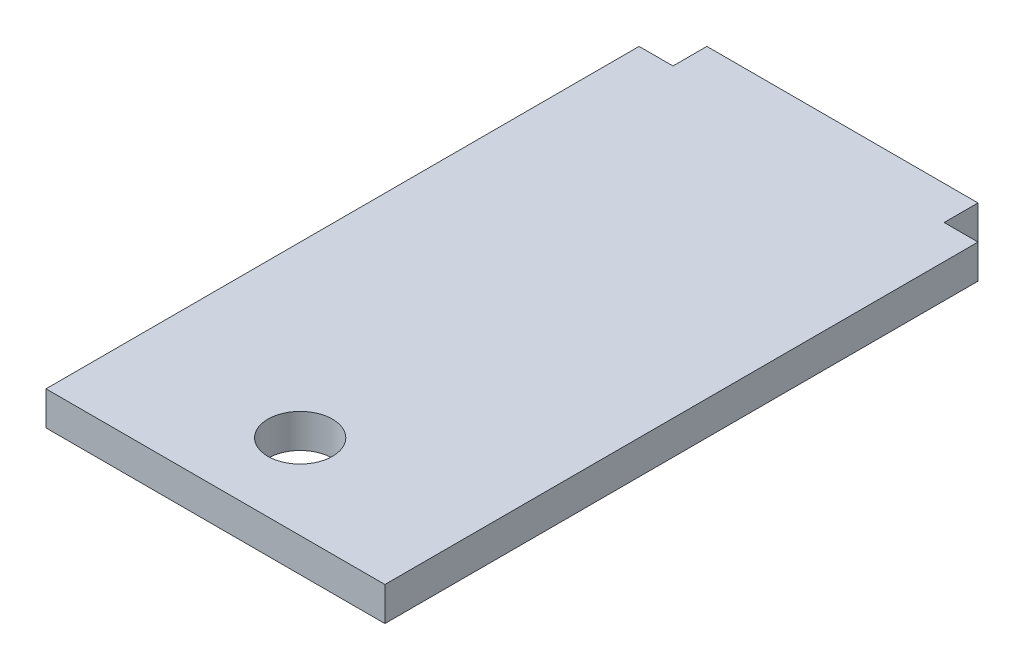
ISO-10303-21;
HEADER;
FILE_DESCRIPTION(('STEP AP214'),'2;1');
FILE_NAME('part.step','',(''),(''),'','','');
FILE_SCHEMA(('AUTOMOTIVE_DESIGN { 1 0 10303 214 1 1 1 1 }'));
ENDSEC;
DATA;
#1=APPLICATION_CONTEXT('core data for automotive mechanical design processes');
#2=APPLICATION_PROTOCOL_DEFINITION('international standard','automotive_design',2000,#1);
#3=PRODUCT_CONTEXT('',#1,'mechanical');
#4=PRODUCT('Part','Part','',(#3));
#5=PRODUCT_RELATED_PRODUCT_CATEGORY('part','',(#4));
#6=PRODUCT_DEFINITION_FORMATION('','',#4);
#7=PRODUCT_DEFINITION_CONTEXT('part definition',#1,'design');
#8=PRODUCT_DEFINITION('design','',#6,#7);
#9=PRODUCT_DEFINITION_SHAPE('','',#8);
#10=(LENGTH_UNIT() NAMED_UNIT(*) SI_UNIT(.MILLI.,.METRE.));
#11=(NAMED_UNIT(*) PLANE_ANGLE_UNIT() SI_UNIT($,.RADIAN.));
#12=(NAMED_UNIT(*) SI_UNIT($,.STERADIAN.) SOLID_ANGLE_UNIT());
#13=UNCERTAINTY_MEASURE_WITH_UNIT(LENGTH_MEASURE(1.E-05),#10,'distance_accuracy_value','');
#14=(GEOMETRIC_REPRESENTATION_CONTEXT(3) GLOBAL_UNCERTAINTY_ASSIGNED_CONTEXT((#13)) GLOBAL_UNIT_ASSIGNED_CONTEXT((#10,
#11,#12)) REPRESENTATION_CONTEXT('',''));
#15=CARTESIAN_POINT('',(0.,0.,0.));
#16=DIRECTION('',(0.,0.,1.));
#17=DIRECTION('',(1.,0.,0.));
#18=AXIS2_PLACEMENT_3D('',#15,#16,#17);
#19=CARTESIAN_POINT('',(0.,5.,0.));
#20=DIRECTION('',(0.,-1.,0.));
#21=DIRECTION('',(0.,0.,-1.));
#22=AXIS2_PLACEMENT_3D('',#19,#20,#21);
#23=PLANE('',#22);
#24=DIRECTION('',(0.,0.,1.));
#25=VECTOR('',#24,1.);
#26=CARTESIAN_POINT('',(0.,5.,0.));
#27=LINE('',#26,#25);
#28=CARTESIAN_POINT('',(0.,5.,-87.5));
#29=VERTEX_POINT('',#28);
#30=CARTESIAN_POINT('',(0.,5.,0.));
#31=VERTEX_POINT('',#30);
#32=EDGE_CURVE('E146',#29,#31,#27,.T.);
#33=ORIENTED_EDGE('',*,*,#32,.T.);
#34=DIRECTION('',(1.,0.,0.));
#35=VECTOR('',#34,1.);
#36=CARTESIAN_POINT('',(0.,5.,0.));
#37=LINE('',#36,#35);
#38=CARTESIAN_POINT('',(50.,5.,0.));
#39=VERTEX_POINT('',#38);
#40=EDGE_CURVE('E94',#31,#39,#37,.T.);
#41=ORIENTED_EDGE('',*,*,#40,.T.);
#42=DIRECTION('',(0.,0.,-1.));
#43=VECTOR('',#42,1.);
#44=CARTESIAN_POINT('',(50.,5.,0.));
#45=LINE('',#44,#43);
#46=CARTESIAN_POINT('',(50.,5.,-87.5));
#47=VERTEX_POINT('',#46);
#48=EDGE_CURVE('E161',#39,#47,#45,.T.);
#49=ORIENTED_EDGE('',*,*,#48,.T.);
#50=DIRECTION('',(-1.,0.,0.));
#51=VECTOR('',#50,1.);
#52=CARTESIAN_POINT('',(50.,5.,-87.5));
#53=LINE('',#52,#51);
#54=CARTESIAN_POINT('',(45.,5.,-87.5));
#55=VERTEX_POINT('',#54);
#56=EDGE_CURVE('E174',#47,#55,#53,.T.);
#57=ORIENTED_EDGE('',*,*,#56,.T.);
#58=DIRECTION('',(0.,0.,-1.));
#59=VECTOR('',#58,1.);
#60=CARTESIAN_POINT('',(45.,5.,-87.5));
#61=LINE('',#60,#59);
#62=CARTESIAN_POINT('',(45.,5.,-92.5));
#63=VERTEX_POINT('',#62);
#64=EDGE_CURVE('E113',#55,#63,#61,.T.);
#65=ORIENTED_EDGE('',*,*,#64,.T.);
#66=DIRECTION('',(-1.,0.,0.));
#67=VECTOR('',#66,1.);
#68=CARTESIAN_POINT('',(5.,5.,-92.5));
#69=LINE('',#68,#67);
#70=CARTESIAN_POINT('',(5.,5.,-92.5));
#71=VERTEX_POINT('',#70);
#72=EDGE_CURVE('E107',#63,#71,#69,.T.);
#73=ORIENTED_EDGE('',*,*,#72,.T.);
#74=DIRECTION('',(0.,0.,1.));
#75=VECTOR('',#74,1.);
#76=CARTESIAN_POINT('',(5.,5.,-92.5));
#77=LINE('',#76,#75);
#78=CARTESIAN_POINT('',(5.,5.,-87.5));
#79=VERTEX_POINT('',#78);
#80=EDGE_CURVE('E111',#71,#79,#77,.T.);
#81=ORIENTED_EDGE('',*,*,#80,.T.);
#82=DIRECTION('',(-1.,0.,0.));
#83=VECTOR('',#82,1.);
#84=CARTESIAN_POINT('',(0.,5.,-87.5));
#85=LINE('',#84,#83);
#86=EDGE_CURVE('E51',#79,#29,#85,.T.);
#87=ORIENTED_EDGE('',*,*,#86,.T.);
#88=EDGE_LOOP('',(#33,#41,#49,#57,#65,#73,#81,#87));
#89=FACE_BOUND('',#88,.T.);
#90=CARTESIAN_POINT('',(25.,5.,-12.5));
#91=DIRECTION('',(0.,1.,0.));
#92=DIRECTION('',(0.,0.,1.));
#93=AXIS2_PLACEMENT_3D('',#90,#91,#92);
#94=CIRCLE('',#93,4.7625);
#95=CARTESIAN_POINT('',(25.,5.,-7.73749999999999));
#96=VERTEX_POINT('',#95);
#97=EDGE_CURVE('E135',#96,#96,#94,.T.);
#98=ORIENTED_EDGE('',*,*,#97,.F.);
#99=EDGE_LOOP('',(#98));
#100=FACE_BOUND('',#99,.T.);
#101=ADVANCED_FACE('F34',(#89,#100),#23,.F.);
#102=CARTESIAN_POINT('',(0.,0.,0.));
#103=DIRECTION('',(0.,-1.,0.));
#104=DIRECTION('',(0.,0.,-1.));
#105=AXIS2_PLACEMENT_3D('',#102,#103,#104);
#106=PLANE('',#105);
#107=DIRECTION('',(0.,0.,1.));
#108=VECTOR('',#107,1.);
#109=CARTESIAN_POINT('',(0.,0.,0.));
#110=LINE('',#109,#108);
#111=CARTESIAN_POINT('',(0.,0.,-87.5));
#112=VERTEX_POINT('',#111);
#113=CARTESIAN_POINT('',(0.,0.,0.));
#114=VERTEX_POINT('',#113);
#115=EDGE_CURVE('E131',#112,#114,#110,.T.);
#116=ORIENTED_EDGE('',*,*,#115,.F.);
#117=DIRECTION('',(-1.,0.,0.));
#118=VECTOR('',#117,1.);
#119=CARTESIAN_POINT('',(0.,0.,-87.5));
#120=LINE('',#119,#118);
#121=CARTESIAN_POINT('',(5.,0.,-87.5));
#122=VERTEX_POINT('',#121);
#123=EDGE_CURVE('E86',#122,#112,#120,.T.);
#124=ORIENTED_EDGE('',*,*,#123,.F.);
#125=DIRECTION('',(0.,0.,1.));
#126=VECTOR('',#125,1.);
#127=CARTESIAN_POINT('',(5.,0.,-92.5));
#128=LINE('',#127,#126);
#129=CARTESIAN_POINT('',(5.,0.,-92.5));
#130=VERTEX_POINT('',#129);
#131=EDGE_CURVE('E80',#130,#122,#128,.T.);
#132=ORIENTED_EDGE('',*,*,#131,.F.);
#133=DIRECTION('',(-1.,0.,0.));
#134=VECTOR('',#133,1.);
#135=CARTESIAN_POINT('',(5.,0.,-92.5));
#136=LINE('',#135,#134);
#137=CARTESIAN_POINT('',(45.,0.,-92.5));
#138=VERTEX_POINT('',#137);
#139=EDGE_CURVE('E121',#138,#130,#136,.T.);
#140=ORIENTED_EDGE('',*,*,#139,.F.);
#141=DIRECTION('',(0.,0.,-1.));
#142=VECTOR('',#141,1.);
#143=CARTESIAN_POINT('',(45.,0.,-87.5));
#144=LINE('',#143,#142);
#145=CARTESIAN_POINT('',(45.,0.,-87.5));
#146=VERTEX_POINT('',#145);
#147=EDGE_CURVE('E141',#146,#138,#144,.T.);
#148=ORIENTED_EDGE('',*,*,#147,.F.);
#149=DIRECTION('',(-1.,0.,0.));
#150=VECTOR('',#149,1.);
#151=CARTESIAN_POINT('',(50.,0.,-87.5));
#152=LINE('',#151,#150);
#153=CARTESIAN_POINT('',(50.,0.,-87.5));
#154=VERTEX_POINT('',#153);
#155=EDGE_CURVE('E139',#154,#146,#152,.T.);
#156=ORIENTED_EDGE('',*,*,#155,.F.);
#157=DIRECTION('',(0.,0.,-1.));
#158=VECTOR('',#157,1.);
#159=CARTESIAN_POINT('',(50.,0.,0.));
#160=LINE('',#159,#158);
#161=CARTESIAN_POINT('',(50.,0.,0.));
#162=VERTEX_POINT('',#161);
#163=EDGE_CURVE('E137',#162,#154,#160,.T.);
#164=ORIENTED_EDGE('',*,*,#163,.F.);
#165=DIRECTION('',(1.,0.,0.));
#166=VECTOR('',#165,1.);
#167=CARTESIAN_POINT('',(0.,0.,0.));
#168=LINE('',#167,#166);
#169=EDGE_CURVE('E134',#114,#162,#168,.T.);
#170=ORIENTED_EDGE('',*,*,#169,.F.);
#171=EDGE_LOOP('',(#116,#124,#132,#140,#148,#156,#164,#170));
#172=FACE_BOUND('',#171,.T.);
#173=CARTESIAN_POINT('',(25.,0.,-12.5));
#174=DIRECTION('',(0.,1.,0.));
#175=DIRECTION('',(0.,0.,1.));
#176=AXIS2_PLACEMENT_3D('',#173,#174,#175);
#177=CIRCLE('',#176,4.7625);
#178=CARTESIAN_POINT('',(25.,0.,-7.73749999999999));
#179=VERTEX_POINT('',#178);
#180=EDGE_CURVE('E180',#179,#179,#177,.T.);
#181=ORIENTED_EDGE('',*,*,#180,.T.);
#182=EDGE_LOOP('',(#181));
#183=FACE_BOUND('',#182,.T.);
#184=ADVANCED_FACE('F165',(#172,#183),#106,.T.);
#185=CARTESIAN_POINT('',(0.,5.,0.));
#186=DIRECTION('',(1.,0.,0.));
#187=DIRECTION('',(0.,0.,-1.));
#188=AXIS2_PLACEMENT_3D('',#185,#186,#187);
#189=PLANE('',#188);
#190=ORIENTED_EDGE('',*,*,#115,.T.);
#191=DIRECTION('',(0.,-1.,0.));
#192=VECTOR('',#191,1.);
#193=CARTESIAN_POINT('',(0.,5.,0.));
#194=LINE('',#193,#192);
#195=EDGE_CURVE('E11',#31,#114,#194,.T.);
#196=ORIENTED_EDGE('',*,*,#195,.F.);
#197=ORIENTED_EDGE('',*,*,#32,.F.);
#198=DIRECTION('',(0.,-1.,0.));
#199=VECTOR('',#198,1.);
#200=CARTESIAN_POINT('',(0.,5.,-87.5));
#201=LINE('',#200,#199);
#202=EDGE_CURVE('E127',#29,#112,#201,.T.);
#203=ORIENTED_EDGE('',*,*,#202,.T.);
#204=EDGE_LOOP('',(#190,#196,#197,#203));
#205=FACE_BOUND('',#204,.T.);
#206=ADVANCED_FACE('F36',(#205),#189,.F.);
#207=CARTESIAN_POINT('',(0.,5.,0.));
#208=DIRECTION('',(0.,0.,-1.));
#209=DIRECTION('',(-1.,0.,0.));
#210=AXIS2_PLACEMENT_3D('',#207,#208,#209);
#211=PLANE('',#210);
#212=ORIENTED_EDGE('',*,*,#169,.T.);
#213=DIRECTION('',(0.,-1.,0.));
#214=VECTOR('',#213,1.);
#215=CARTESIAN_POINT('',(50.,5.,0.));
#216=LINE('',#215,#214);
#217=EDGE_CURVE('E43',#39,#162,#216,.T.);
#218=ORIENTED_EDGE('',*,*,#217,.F.);
#219=ORIENTED_EDGE('',*,*,#40,.F.);
#220=ORIENTED_EDGE('',*,*,#195,.T.);
#221=EDGE_LOOP('',(#212,#218,#219,#220));
#222=FACE_BOUND('',#221,.T.);
#223=ADVANCED_FACE('F208',(#222),#211,.F.);
#224=CARTESIAN_POINT('',(50.,5.,0.));
#225=DIRECTION('',(-1.,0.,0.));
#226=DIRECTION('',(0.,0.,1.));
#227=AXIS2_PLACEMENT_3D('',#224,#225,#226);
#228=PLANE('',#227);
#229=ORIENTED_EDGE('',*,*,#163,.T.);
#230=DIRECTION('',(0.,-1.,0.));
#231=VECTOR('',#230,1.);
#232=CARTESIAN_POINT('',(50.,5.,-87.5));
#233=LINE('',#232,#231);
#234=EDGE_CURVE('E153',#47,#154,#233,.T.);
#235=ORIENTED_EDGE('',*,*,#234,.F.);
#236=ORIENTED_EDGE('',*,*,#48,.F.);
#237=ORIENTED_EDGE('',*,*,#217,.T.);
#238=EDGE_LOOP('',(#229,#235,#236,#237));
#239=FACE_BOUND('',#238,.T.);
#240=ADVANCED_FACE('F159',(#239),#228,.F.);
#241=CARTESIAN_POINT('',(50.,5.,-87.5));
#242=DIRECTION('',(0.,0.,1.));
#243=DIRECTION('',(1.,0.,0.));
#244=AXIS2_PLACEMENT_3D('',#241,#242,#243);
#245=PLANE('',#244);
#246=ORIENTED_EDGE('',*,*,#155,.T.);
#247=DIRECTION('',(0.,-1.,0.));
#248=VECTOR('',#247,1.);
#249=CARTESIAN_POINT('',(45.,5.,-87.5));
#250=LINE('',#249,#248);
#251=EDGE_CURVE('E150',#55,#146,#250,.T.);
#252=ORIENTED_EDGE('',*,*,#251,.F.);
#253=ORIENTED_EDGE('',*,*,#56,.F.);
#254=ORIENTED_EDGE('',*,*,#234,.T.);
#255=EDGE_LOOP('',(#246,#252,#253,#254));
#256=FACE_BOUND('',#255,.T.);
#257=ADVANCED_FACE('F170',(#256),#245,.F.);
#258=CARTESIAN_POINT('',(45.,5.,-87.5));
#259=DIRECTION('',(-1.,0.,0.));
#260=DIRECTION('',(0.,0.,1.));
#261=AXIS2_PLACEMENT_3D('',#258,#259,#260);
#262=PLANE('',#261);
#263=ORIENTED_EDGE('',*,*,#147,.T.);
#264=DIRECTION('',(0.,-1.,0.));
#265=VECTOR('',#264,1.);
#266=CARTESIAN_POINT('',(45.,5.,-92.5));
#267=LINE('',#266,#265);
#268=EDGE_CURVE('E122',#63,#138,#267,.T.);
#269=ORIENTED_EDGE('',*,*,#268,.F.);
#270=ORIENTED_EDGE('',*,*,#64,.F.);
#271=ORIENTED_EDGE('',*,*,#251,.T.);
#272=EDGE_LOOP('',(#263,#269,#270,#271));
#273=FACE_BOUND('',#272,.T.);
#274=ADVANCED_FACE('F173',(#273),#262,.F.);
#275=CARTESIAN_POINT('',(5.,5.,-92.5));
#276=DIRECTION('',(0.,0.,1.));
#277=DIRECTION('',(1.,0.,0.));
#278=AXIS2_PLACEMENT_3D('',#275,#276,#277);
#279=PLANE('',#278);
#280=ORIENTED_EDGE('',*,*,#139,.T.);
#281=DIRECTION('',(0.,-1.,0.));
#282=VECTOR('',#281,1.);
#283=CARTESIAN_POINT('',(5.,5.,-92.5));
#284=LINE('',#283,#282);
#285=EDGE_CURVE('E118',#71,#130,#284,.T.);
#286=ORIENTED_EDGE('',*,*,#285,.F.);
#287=ORIENTED_EDGE('',*,*,#72,.F.);
#288=ORIENTED_EDGE('',*,*,#268,.T.);
#289=EDGE_LOOP('',(#280,#286,#287,#288));
#290=FACE_BOUND('',#289,.T.);
#291=ADVANCED_FACE('F119',(#290),#279,.F.);
#292=CARTESIAN_POINT('',(5.,5.,-92.5));
#293=DIRECTION('',(1.,0.,0.));
#294=DIRECTION('',(0.,0.,-1.));
#295=AXIS2_PLACEMENT_3D('',#292,#293,#294);
#296=PLANE('',#295);
#297=ORIENTED_EDGE('',*,*,#131,.T.);
#298=DIRECTION('',(0.,-1.,0.));
#299=VECTOR('',#298,1.);
#300=CARTESIAN_POINT('',(5.,5.,-87.5));
#301=LINE('',#300,#299);
#302=EDGE_CURVE('E123',#79,#122,#301,.T.);
#303=ORIENTED_EDGE('',*,*,#302,.F.);
#304=ORIENTED_EDGE('',*,*,#80,.F.);
#305=ORIENTED_EDGE('',*,*,#285,.T.);
#306=EDGE_LOOP('',(#297,#303,#304,#305));
#307=FACE_BOUND('',#306,.T.);
#308=ADVANCED_FACE('F125',(#307),#296,.F.);
#309=CARTESIAN_POINT('',(0.,5.,-87.5));
#310=DIRECTION('',(0.,0.,1.));
#311=DIRECTION('',(1.,0.,0.));
#312=AXIS2_PLACEMENT_3D('',#309,#310,#311);
#313=PLANE('',#312);
#314=ORIENTED_EDGE('',*,*,#123,.T.);
#315=ORIENTED_EDGE('',*,*,#202,.F.);
#316=ORIENTED_EDGE('',*,*,#86,.F.);
#317=ORIENTED_EDGE('',*,*,#302,.T.);
#318=EDGE_LOOP('',(#314,#315,#316,#317));
#319=FACE_BOUND('',#318,.T.);
#320=ADVANCED_FACE('F196',(#319),#313,.F.);
#321=CARTESIAN_POINT('',(25.,5.,-12.5));
#322=DIRECTION('',(0.,-1.,0.));
#323=DIRECTION('',(0.,0.,-1.));
#324=AXIS2_PLACEMENT_3D('',#321,#322,#323);
#325=CYLINDRICAL_SURFACE('',#324,4.7625);
#326=ORIENTED_EDGE('',*,*,#97,.T.);
#327=EDGE_LOOP('',(#326));
#328=FACE_BOUND('',#327,.T.);
#329=ORIENTED_EDGE('',*,*,#180,.F.);
#330=EDGE_LOOP('',(#329));
#331=FACE_BOUND('',#330,.T.);
#332=ADVANCED_FACE('F186',(#328,#331),#325,.F.);
#333=CLOSED_SHELL('',(#101,#184,#206,#223,#240,#257,#274,#291,#308,#320,#332));
#334=MANIFOLD_SOLID_BREP('B2',#333);
#335=ADVANCED_BREP_SHAPE_REPRESENTATION('',(#18,#334),#14);
#336=SHAPE_DEFINITION_REPRESENTATION(#9,#335);
ENDSEC;
END-ISO-10303-21;
